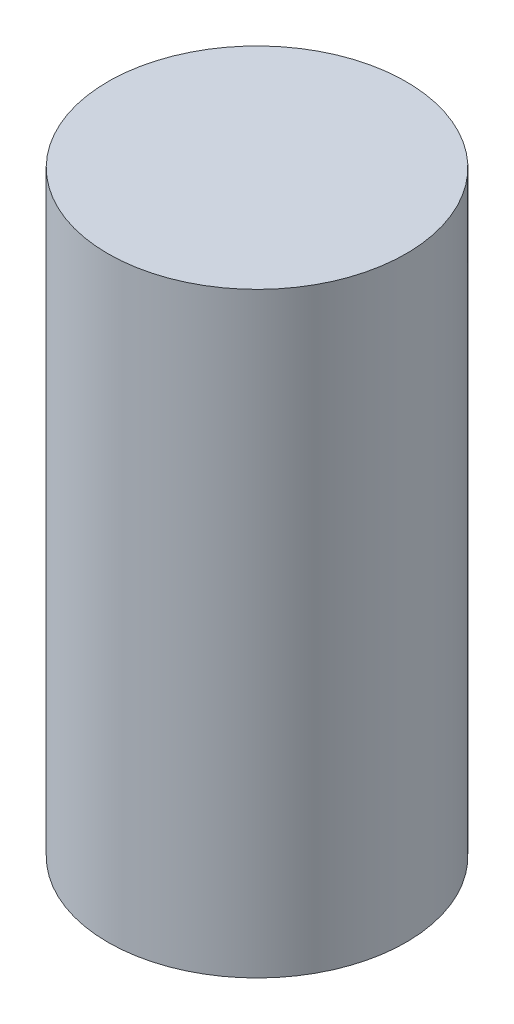
ISO-10303-21;
HEADER;
FILE_DESCRIPTION(('STEP AP214'),'2;1');
FILE_NAME('part.step','',(''),(''),'','','');
FILE_SCHEMA(('AUTOMOTIVE_DESIGN { 1 0 10303 214 1 1 1 1 }'));
ENDSEC;
DATA;
#1=APPLICATION_CONTEXT('core data for automotive mechanical design processes');
#2=APPLICATION_PROTOCOL_DEFINITION('international standard','automotive_design',2000,#1);
#3=PRODUCT_CONTEXT('',#1,'mechanical');
#4=PRODUCT('Part','Part','',(#3));
#5=PRODUCT_RELATED_PRODUCT_CATEGORY('part','',(#4));
#6=PRODUCT_DEFINITION_FORMATION('','',#4);
#7=PRODUCT_DEFINITION_CONTEXT('part definition',#1,'design');
#8=PRODUCT_DEFINITION('design','',#6,#7);
#9=PRODUCT_DEFINITION_SHAPE('','',#8);
#10=(LENGTH_UNIT() NAMED_UNIT(*) SI_UNIT(.MILLI.,.METRE.));
#11=(NAMED_UNIT(*) PLANE_ANGLE_UNIT() SI_UNIT($,.RADIAN.));
#12=(NAMED_UNIT(*) SI_UNIT($,.STERADIAN.) SOLID_ANGLE_UNIT());
#13=UNCERTAINTY_MEASURE_WITH_UNIT(LENGTH_MEASURE(1.E-05),#10,'distance_accuracy_value','');
#14=(GEOMETRIC_REPRESENTATION_CONTEXT(3) GLOBAL_UNCERTAINTY_ASSIGNED_CONTEXT((#13)) GLOBAL_UNIT_ASSIGNED_CONTEXT((#10,
#11,#12)) REPRESENTATION_CONTEXT('',''));
#15=CARTESIAN_POINT('',(0.,0.,0.));
#16=DIRECTION('',(0.,0.,1.));
#17=DIRECTION('',(1.,0.,0.));
#18=AXIS2_PLACEMENT_3D('',#15,#16,#17);
#19=CARTESIAN_POINT('',(0.,80.,0.));
#20=DIRECTION('',(0.,-1.,0.));
#21=DIRECTION('',(0.,0.,-1.));
#22=AXIS2_PLACEMENT_3D('',#19,#20,#21);
#23=CYLINDRICAL_SURFACE('',#22,20.);
#24=CARTESIAN_POINT('',(0.,80.,0.));
#25=DIRECTION('',(0.,1.,0.));
#26=DIRECTION('',(0.,0.,1.));
#27=AXIS2_PLACEMENT_3D('',#24,#25,#26);
#28=CIRCLE('',#27,20.);
#29=CARTESIAN_POINT('',(0.,80.,20.));
#30=VERTEX_POINT('',#29);
#31=EDGE_CURVE('E10',#30,#30,#28,.T.);
#32=ORIENTED_EDGE('',*,*,#31,.F.);
#33=EDGE_LOOP('',(#32));
#34=FACE_BOUND('',#33,.T.);
#35=CARTESIAN_POINT('',(0.,0.,0.));
#36=DIRECTION('',(0.,1.,0.));
#37=DIRECTION('',(0.,0.,1.));
#38=AXIS2_PLACEMENT_3D('',#35,#36,#37);
#39=CIRCLE('',#38,20.);
#40=CARTESIAN_POINT('',(0.,0.,20.));
#41=VERTEX_POINT('',#40);
#42=EDGE_CURVE('E38',#41,#41,#39,.T.);
#43=ORIENTED_EDGE('',*,*,#42,.T.);
#44=EDGE_LOOP('',(#43));
#45=FACE_BOUND('',#44,.T.);
#46=ADVANCED_FACE('F35',(#34,#45),#23,.T.);
#47=CARTESIAN_POINT('',(0.,80.,0.));
#48=DIRECTION('',(0.,1.,0.));
#49=DIRECTION('',(0.,0.,1.));
#50=AXIS2_PLACEMENT_3D('',#47,#48,#49);
#51=PLANE('',#50);
#52=ORIENTED_EDGE('',*,*,#31,.T.);
#53=EDGE_LOOP('',(#52));
#54=FACE_BOUND('',#53,.T.);
#55=ADVANCED_FACE('F50',(#54),#51,.T.);
#56=CARTESIAN_POINT('',(0.,0.,0.));
#57=DIRECTION('',(0.,1.,0.));
#58=DIRECTION('',(0.,0.,1.));
#59=AXIS2_PLACEMENT_3D('',#56,#57,#58);
#60=PLANE('',#59);
#61=ORIENTED_EDGE('',*,*,#42,.F.);
#62=EDGE_LOOP('',(#61));
#63=FACE_BOUND('',#62,.T.);
#64=ADVANCED_FACE('F48',(#63),#60,.F.);
#65=CLOSED_SHELL('',(#46,#55,#64));
#66=MANIFOLD_SOLID_BREP('B2',#65);
#67=ADVANCED_BREP_SHAPE_REPRESENTATION('',(#18,#66),#14);
#68=SHAPE_DEFINITION_REPRESENTATION(#9,#67);
ENDSEC;
END-ISO-10303-21;
